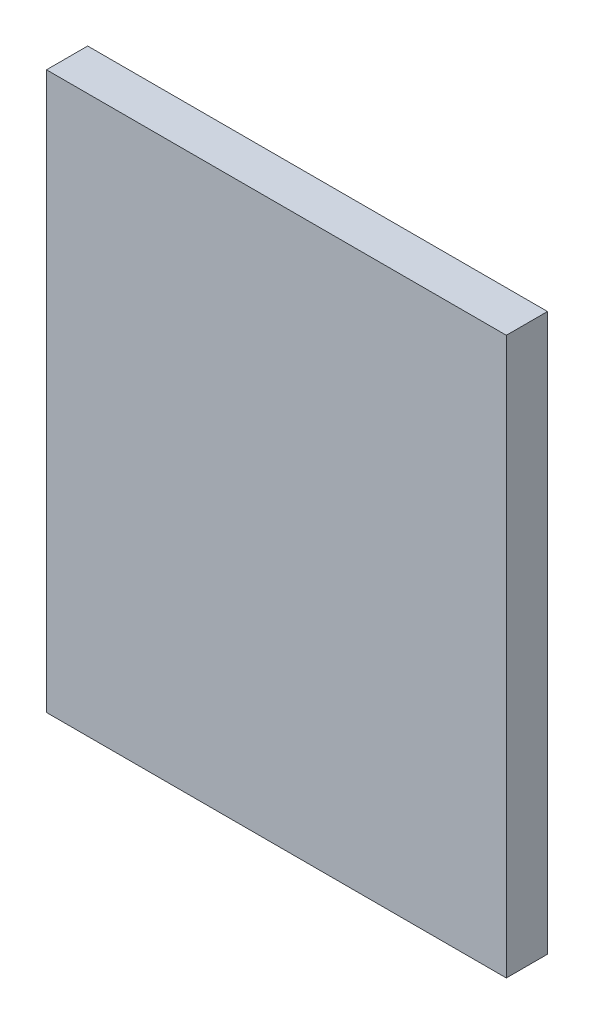
ISO-10303-21;
HEADER;
FILE_DESCRIPTION(('STEP AP214'),'2;1');
FILE_NAME('part.step','',(''),(''),'','','');
FILE_SCHEMA(('AUTOMOTIVE_DESIGN { 1 0 10303 214 1 1 1 1 }'));
ENDSEC;
DATA;
#1=APPLICATION_CONTEXT('core data for automotive mechanical design processes');
#2=APPLICATION_PROTOCOL_DEFINITION('international standard','automotive_design',2000,#1);
#3=PRODUCT_CONTEXT('',#1,'mechanical');
#4=PRODUCT('Part','Part','',(#3));
#5=PRODUCT_RELATED_PRODUCT_CATEGORY('part','',(#4));
#6=PRODUCT_DEFINITION_FORMATION('','',#4);
#7=PRODUCT_DEFINITION_CONTEXT('part definition',#1,'design');
#8=PRODUCT_DEFINITION('design','',#6,#7);
#9=PRODUCT_DEFINITION_SHAPE('','',#8);
#10=(LENGTH_UNIT() NAMED_UNIT(*) SI_UNIT(.MILLI.,.METRE.));
#11=(NAMED_UNIT(*) PLANE_ANGLE_UNIT() SI_UNIT($,.RADIAN.));
#12=(NAMED_UNIT(*) SI_UNIT($,.STERADIAN.) SOLID_ANGLE_UNIT());
#13=UNCERTAINTY_MEASURE_WITH_UNIT(LENGTH_MEASURE(1.E-05),#10,'distance_accuracy_value','');
#14=(GEOMETRIC_REPRESENTATION_CONTEXT(3) GLOBAL_UNCERTAINTY_ASSIGNED_CONTEXT((#13)) GLOBAL_UNIT_ASSIGNED_CONTEXT((#10,
#11,#12)) REPRESENTATION_CONTEXT('',''));
#15=CARTESIAN_POINT('',(0.,0.,0.));
#16=DIRECTION('',(0.,0.,1.));
#17=DIRECTION('',(1.,0.,0.));
#18=AXIS2_PLACEMENT_3D('',#15,#16,#17);
#19=CARTESIAN_POINT('',(0.,0.,3.));
#20=DIRECTION('',(1.,0.,0.));
#21=DIRECTION('',(0.,0.,-1.));
#22=AXIS2_PLACEMENT_3D('',#19,#20,#21);
#23=PLANE('',#22);
#24=DIRECTION('',(0.,-1.,0.));
#25=VECTOR('',#24,1.);
#26=CARTESIAN_POINT('',(0.,0.,0.));
#27=LINE('',#26,#25);
#28=CARTESIAN_POINT('',(0.,40.55,0.));
#29=VERTEX_POINT('',#28);
#30=CARTESIAN_POINT('',(0.,0.,0.));
#31=VERTEX_POINT('',#30);
#32=EDGE_CURVE('E96',#29,#31,#27,.T.);
#33=ORIENTED_EDGE('',*,*,#32,.T.);
#34=DIRECTION('',(0.,0.,-1.));
#35=VECTOR('',#34,1.);
#36=CARTESIAN_POINT('',(0.,0.,3.));
#37=LINE('',#36,#35);
#38=CARTESIAN_POINT('',(0.,0.,3.));
#39=VERTEX_POINT('',#38);
#40=EDGE_CURVE('E11',#39,#31,#37,.T.);
#41=ORIENTED_EDGE('',*,*,#40,.F.);
#42=DIRECTION('',(0.,-1.,0.));
#43=VECTOR('',#42,1.);
#44=CARTESIAN_POINT('',(0.,0.,3.));
#45=LINE('',#44,#43);
#46=CARTESIAN_POINT('',(0.,40.55,3.));
#47=VERTEX_POINT('',#46);
#48=EDGE_CURVE('E84',#47,#39,#45,.T.);
#49=ORIENTED_EDGE('',*,*,#48,.F.);
#50=DIRECTION('',(0.,0.,-1.));
#51=VECTOR('',#50,1.);
#52=CARTESIAN_POINT('',(0.,40.55,3.));
#53=LINE('',#52,#51);
#54=EDGE_CURVE('E92',#47,#29,#53,.T.);
#55=ORIENTED_EDGE('',*,*,#54,.T.);
#56=EDGE_LOOP('',(#33,#41,#49,#55));
#57=FACE_BOUND('',#56,.T.);
#58=ADVANCED_FACE('F33',(#57),#23,.F.);
#59=CARTESIAN_POINT('',(0.,0.,3.));
#60=DIRECTION('',(0.,1.,0.));
#61=DIRECTION('',(0.,0.,1.));
#62=AXIS2_PLACEMENT_3D('',#59,#60,#61);
#63=PLANE('',#62);
#64=DIRECTION('',(1.,0.,0.));
#65=VECTOR('',#64,1.);
#66=CARTESIAN_POINT('',(0.,0.,0.));
#67=LINE('',#66,#65);
#68=CARTESIAN_POINT('',(33.5,0.,0.));
#69=VERTEX_POINT('',#68);
#70=EDGE_CURVE('E88',#31,#69,#67,.T.);
#71=ORIENTED_EDGE('',*,*,#70,.T.);
#72=DIRECTION('',(0.,0.,-1.));
#73=VECTOR('',#72,1.);
#74=CARTESIAN_POINT('',(33.5,0.,3.));
#75=LINE('',#74,#73);
#76=CARTESIAN_POINT('',(33.5,0.,3.));
#77=VERTEX_POINT('',#76);
#78=EDGE_CURVE('E41',#77,#69,#75,.T.);
#79=ORIENTED_EDGE('',*,*,#78,.F.);
#80=DIRECTION('',(1.,0.,0.));
#81=VECTOR('',#80,1.);
#82=CARTESIAN_POINT('',(0.,0.,3.));
#83=LINE('',#82,#81);
#84=EDGE_CURVE('E79',#39,#77,#83,.T.);
#85=ORIENTED_EDGE('',*,*,#84,.F.);
#86=ORIENTED_EDGE('',*,*,#40,.T.);
#87=EDGE_LOOP('',(#71,#79,#85,#86));
#88=FACE_BOUND('',#87,.T.);
#89=ADVANCED_FACE('F87',(#88),#63,.F.);
#90=CARTESIAN_POINT('',(33.5,0.,3.));
#91=DIRECTION('',(-1.,0.,0.));
#92=DIRECTION('',(0.,0.,1.));
#93=AXIS2_PLACEMENT_3D('',#90,#91,#92);
#94=PLANE('',#93);
#95=DIRECTION('',(0.,1.,0.));
#96=VECTOR('',#95,1.);
#97=CARTESIAN_POINT('',(33.5,0.,0.));
#98=LINE('',#97,#96);
#99=CARTESIAN_POINT('',(33.5,40.55,0.));
#100=VERTEX_POINT('',#99);
#101=EDGE_CURVE('E66',#69,#100,#98,.T.);
#102=ORIENTED_EDGE('',*,*,#101,.T.);
#103=DIRECTION('',(0.,0.,-1.));
#104=VECTOR('',#103,1.);
#105=CARTESIAN_POINT('',(33.5,40.55,3.));
#106=LINE('',#105,#104);
#107=CARTESIAN_POINT('',(33.5,40.55,3.));
#108=VERTEX_POINT('',#107);
#109=EDGE_CURVE('E89',#108,#100,#106,.T.);
#110=ORIENTED_EDGE('',*,*,#109,.F.);
#111=DIRECTION('',(0.,1.,0.));
#112=VECTOR('',#111,1.);
#113=CARTESIAN_POINT('',(33.5,0.,3.));
#114=LINE('',#113,#112);
#115=EDGE_CURVE('E82',#77,#108,#114,.T.);
#116=ORIENTED_EDGE('',*,*,#115,.F.);
#117=ORIENTED_EDGE('',*,*,#78,.T.);
#118=EDGE_LOOP('',(#102,#110,#116,#117));
#119=FACE_BOUND('',#118,.T.);
#120=ADVANCED_FACE('F90',(#119),#94,.F.);
#121=CARTESIAN_POINT('',(0.,40.55,3.));
#122=DIRECTION('',(0.,-1.,0.));
#123=DIRECTION('',(0.,0.,-1.));
#124=AXIS2_PLACEMENT_3D('',#121,#122,#123);
#125=PLANE('',#124);
#126=DIRECTION('',(-1.,0.,0.));
#127=VECTOR('',#126,1.);
#128=CARTESIAN_POINT('',(0.,40.55,0.));
#129=LINE('',#128,#127);
#130=EDGE_CURVE('E72',#100,#29,#129,.T.);
#131=ORIENTED_EDGE('',*,*,#130,.T.);
#132=ORIENTED_EDGE('',*,*,#54,.F.);
#133=DIRECTION('',(-1.,0.,0.));
#134=VECTOR('',#133,1.);
#135=CARTESIAN_POINT('',(0.,40.55,3.));
#136=LINE('',#135,#134);
#137=EDGE_CURVE('E49',#108,#47,#136,.T.);
#138=ORIENTED_EDGE('',*,*,#137,.F.);
#139=ORIENTED_EDGE('',*,*,#109,.T.);
#140=EDGE_LOOP('',(#131,#132,#138,#139));
#141=FACE_BOUND('',#140,.T.);
#142=ADVANCED_FACE('F103',(#141),#125,.F.);
#143=CARTESIAN_POINT('',(0.,0.,3.));
#144=DIRECTION('',(0.,0.,-1.));
#145=DIRECTION('',(-1.,0.,0.));
#146=AXIS2_PLACEMENT_3D('',#143,#144,#145);
#147=PLANE('',#146);
#148=ORIENTED_EDGE('',*,*,#48,.T.);
#149=ORIENTED_EDGE('',*,*,#84,.T.);
#150=ORIENTED_EDGE('',*,*,#115,.T.);
#151=ORIENTED_EDGE('',*,*,#137,.T.);
#152=EDGE_LOOP('',(#148,#149,#150,#151));
#153=FACE_BOUND('',#152,.T.);
#154=ADVANCED_FACE('F80',(#153),#147,.F.);
#155=CARTESIAN_POINT('',(0.,0.,0.));
#156=DIRECTION('',(0.,0.,-1.));
#157=DIRECTION('',(-1.,0.,0.));
#158=AXIS2_PLACEMENT_3D('',#155,#156,#157);
#159=PLANE('',#158);
#160=ORIENTED_EDGE('',*,*,#32,.F.);
#161=ORIENTED_EDGE('',*,*,#130,.F.);
#162=ORIENTED_EDGE('',*,*,#101,.F.);
#163=ORIENTED_EDGE('',*,*,#70,.F.);
#164=EDGE_LOOP('',(#160,#161,#162,#163));
#165=FACE_BOUND('',#164,.T.);
#166=ADVANCED_FACE('F106',(#165),#159,.T.);
#167=CLOSED_SHELL('',(#58,#89,#120,#142,#154,#166));
#168=MANIFOLD_SOLID_BREP('B2',#167);
#169=ADVANCED_BREP_SHAPE_REPRESENTATION('',(#18,#168),#14);
#170=SHAPE_DEFINITION_REPRESENTATION(#9,#169);
ENDSEC;
END-ISO-10303-21;
